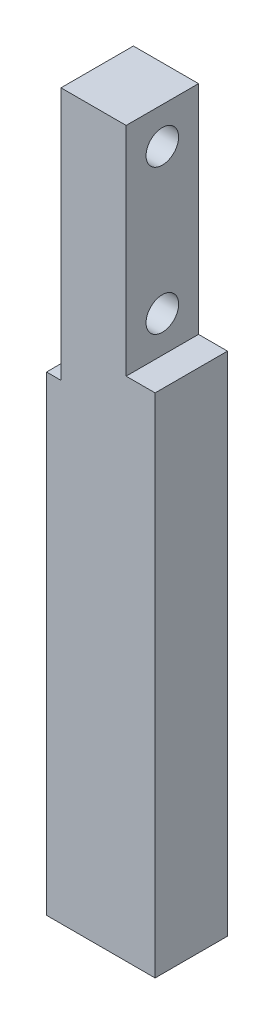
ISO-10303-21;
HEADER;
FILE_DESCRIPTION(('STEP AP214'),'2;1');
FILE_NAME('part.step','',(''),(''),'','','');
FILE_SCHEMA(('AUTOMOTIVE_DESIGN { 1 0 10303 214 1 1 1 1 }'));
ENDSEC;
DATA;
#1=APPLICATION_CONTEXT('core data for automotive mechanical design processes');
#2=APPLICATION_PROTOCOL_DEFINITION('international standard','automotive_design',2000,#1);
#3=PRODUCT_CONTEXT('',#1,'mechanical');
#4=PRODUCT('Part','Part','',(#3));
#5=PRODUCT_RELATED_PRODUCT_CATEGORY('part','',(#4));
#6=PRODUCT_DEFINITION_FORMATION('','',#4);
#7=PRODUCT_DEFINITION_CONTEXT('part definition',#1,'design');
#8=PRODUCT_DEFINITION('design','',#6,#7);
#9=PRODUCT_DEFINITION_SHAPE('','',#8);
#10=(LENGTH_UNIT() NAMED_UNIT(*) SI_UNIT(.MILLI.,.METRE.));
#11=(NAMED_UNIT(*) PLANE_ANGLE_UNIT() SI_UNIT($,.RADIAN.));
#12=(NAMED_UNIT(*) SI_UNIT($,.STERADIAN.) SOLID_ANGLE_UNIT());
#13=UNCERTAINTY_MEASURE_WITH_UNIT(LENGTH_MEASURE(1.E-05),#10,'distance_accuracy_value','');
#14=(GEOMETRIC_REPRESENTATION_CONTEXT(3) GLOBAL_UNCERTAINTY_ASSIGNED_CONTEXT((#13)) GLOBAL_UNIT_ASSIGNED_CONTEXT((#10,
#11,#12)) REPRESENTATION_CONTEXT('',''));
#15=CARTESIAN_POINT('',(0.,0.,0.));
#16=DIRECTION('',(0.,0.,1.));
#17=DIRECTION('',(1.,0.,0.));
#18=AXIS2_PLACEMENT_3D('',#15,#16,#17);
#19=CARTESIAN_POINT('',(-7.61200000000001,27.794,10.));
#20=DIRECTION('',(1.,0.,0.));
#21=DIRECTION('',(0.,0.,-1.));
#22=AXIS2_PLACEMENT_3D('',#19,#20,#21);
#23=PLANE('',#22);
#24=CARTESIAN_POINT('',(-7.61200000000001,37.794,5.));
#25=DIRECTION('',(-1.,0.,0.));
#26=DIRECTION('',(0.,0.,1.));
#27=AXIS2_PLACEMENT_3D('',#24,#25,#26);
#28=CIRCLE('',#27,4.);
#29=CARTESIAN_POINT('',(-7.61200000000001,37.794,9.00000000000001));
#30=VERTEX_POINT('',#29);
#31=EDGE_CURVE('E188',#30,#30,#28,.T.);
#32=ORIENTED_EDGE('',*,*,#31,.F.);
#33=EDGE_LOOP('',(#32));
#34=FACE_BOUND('',#33,.T.);
#35=CARTESIAN_POINT('',(-7.61200000000001,57.794,5.));
#36=DIRECTION('',(-1.,0.,0.));
#37=DIRECTION('',(0.,0.,1.));
#38=AXIS2_PLACEMENT_3D('',#35,#36,#37);
#39=CIRCLE('',#38,4.);
#40=CARTESIAN_POINT('',(-7.61200000000001,57.794,9.00000000000001));
#41=VERTEX_POINT('',#40);
#42=EDGE_CURVE('E182',#41,#41,#39,.T.);
#43=ORIENTED_EDGE('',*,*,#42,.F.);
#44=EDGE_LOOP('',(#43));
#45=FACE_BOUND('',#44,.T.);
#46=DIRECTION('',(0.,-1.,0.));
#47=VECTOR('',#46,1.);
#48=CARTESIAN_POINT('',(-7.61200000000001,27.794,0.));
#49=LINE('',#48,#47);
#50=CARTESIAN_POINT('',(-7.61200000000001,62.794,0.));
#51=VERTEX_POINT('',#50);
#52=CARTESIAN_POINT('',(-7.61200000000001,27.794,0.));
#53=VERTEX_POINT('',#52);
#54=EDGE_CURVE('E134',#51,#53,#49,.T.);
#55=ORIENTED_EDGE('',*,*,#54,.T.);
#56=DIRECTION('',(0.,0.,-1.));
#57=VECTOR('',#56,1.);
#58=CARTESIAN_POINT('',(-7.61200000000001,27.794,10.));
#59=LINE('',#58,#57);
#60=CARTESIAN_POINT('',(-7.61200000000001,27.794,10.));
#61=VERTEX_POINT('',#60);
#62=EDGE_CURVE('E11',#61,#53,#59,.T.);
#63=ORIENTED_EDGE('',*,*,#62,.F.);
#64=DIRECTION('',(0.,-1.,0.));
#65=VECTOR('',#64,1.);
#66=CARTESIAN_POINT('',(-7.61200000000001,27.794,10.));
#67=LINE('',#66,#65);
#68=CARTESIAN_POINT('',(-7.61200000000001,62.794,10.));
#69=VERTEX_POINT('',#68);
#70=EDGE_CURVE('E149',#69,#61,#67,.T.);
#71=ORIENTED_EDGE('',*,*,#70,.F.);
#72=DIRECTION('',(0.,0.,-1.));
#73=VECTOR('',#72,1.);
#74=CARTESIAN_POINT('',(-7.61200000000001,62.794,10.));
#75=LINE('',#74,#73);
#76=EDGE_CURVE('E130',#69,#51,#75,.T.);
#77=ORIENTED_EDGE('',*,*,#76,.T.);
#78=EDGE_LOOP('',(#55,#63,#71,#77));
#79=FACE_BOUND('',#78,.T.);
#80=ADVANCED_FACE('F35',(#34,#45,#79),#23,.F.);
#81=CARTESIAN_POINT('',(-9.612,27.794,10.));
#82=DIRECTION('',(0.,-1.,0.));
#83=DIRECTION('',(0.,0.,-1.));
#84=AXIS2_PLACEMENT_3D('',#81,#82,#83);
#85=PLANE('',#84);
#86=DIRECTION('',(-1.,0.,0.));
#87=VECTOR('',#86,1.);
#88=CARTESIAN_POINT('',(-9.612,27.794,0.));
#89=LINE('',#88,#87);
#90=CARTESIAN_POINT('',(-9.612,27.794,0.));
#91=VERTEX_POINT('',#90);
#92=EDGE_CURVE('E137',#53,#91,#89,.T.);
#93=ORIENTED_EDGE('',*,*,#92,.T.);
#94=DIRECTION('',(0.,0.,-1.));
#95=VECTOR('',#94,1.);
#96=CARTESIAN_POINT('',(-9.612,27.794,10.));
#97=LINE('',#96,#95);
#98=CARTESIAN_POINT('',(-9.612,27.794,10.));
#99=VERTEX_POINT('',#98);
#100=EDGE_CURVE('E43',#99,#91,#97,.T.);
#101=ORIENTED_EDGE('',*,*,#100,.F.);
#102=DIRECTION('',(-1.,0.,0.));
#103=VECTOR('',#102,1.);
#104=CARTESIAN_POINT('',(-9.612,27.794,10.));
#105=LINE('',#104,#103);
#106=EDGE_CURVE('E95',#61,#99,#105,.T.);
#107=ORIENTED_EDGE('',*,*,#106,.F.);
#108=ORIENTED_EDGE('',*,*,#62,.T.);
#109=EDGE_LOOP('',(#93,#101,#107,#108));
#110=FACE_BOUND('',#109,.T.);
#111=ADVANCED_FACE('F222',(#110),#85,.F.);
#112=CARTESIAN_POINT('',(-9.612,-37.206,10.));
#113=DIRECTION('',(1.,0.,0.));
#114=DIRECTION('',(0.,0.,-1.));
#115=AXIS2_PLACEMENT_3D('',#112,#113,#114);
#116=PLANE('',#115);
#117=CARTESIAN_POINT('',(-9.61200000000001,2.794,5.00000000000001));
#118=DIRECTION('',(-1.,0.,0.));
#119=DIRECTION('',(0.,0.,1.));
#120=AXIS2_PLACEMENT_3D('',#117,#118,#119);
#121=CIRCLE('',#120,1.64999999999999);
#122=CARTESIAN_POINT('',(-9.61200000000001,2.794,6.65));
#123=VERTEX_POINT('',#122);
#124=EDGE_CURVE('E214',#123,#123,#121,.T.);
#125=ORIENTED_EDGE('',*,*,#124,.F.);
#126=EDGE_LOOP('',(#125));
#127=FACE_BOUND('',#126,.T.);
#128=CARTESIAN_POINT('',(-9.61200000000001,-27.206,5.));
#129=DIRECTION('',(-1.,0.,0.));
#130=DIRECTION('',(0.,0.,1.));
#131=AXIS2_PLACEMENT_3D('',#128,#129,#130);
#132=CIRCLE('',#131,1.64999999999999);
#133=CARTESIAN_POINT('',(-9.61200000000001,-27.206,6.64999999999999));
#134=VERTEX_POINT('',#133);
#135=EDGE_CURVE('E208',#134,#134,#132,.T.);
#136=ORIENTED_EDGE('',*,*,#135,.F.);
#137=EDGE_LOOP('',(#136));
#138=FACE_BOUND('',#137,.T.);
#139=DIRECTION('',(0.,-1.,0.));
#140=VECTOR('',#139,1.);
#141=CARTESIAN_POINT('',(-9.612,-37.206,0.));
#142=LINE('',#141,#140);
#143=CARTESIAN_POINT('',(-9.612,-37.206,0.));
#144=VERTEX_POINT('',#143);
#145=EDGE_CURVE('E140',#91,#144,#142,.T.);
#146=ORIENTED_EDGE('',*,*,#145,.T.);
#147=DIRECTION('',(0.,0.,-1.));
#148=VECTOR('',#147,1.);
#149=CARTESIAN_POINT('',(-9.612,-37.206,10.));
#150=LINE('',#149,#148);
#151=CARTESIAN_POINT('',(-9.612,-37.206,10.));
#152=VERTEX_POINT('',#151);
#153=EDGE_CURVE('E156',#152,#144,#150,.T.);
#154=ORIENTED_EDGE('',*,*,#153,.F.);
#155=DIRECTION('',(0.,-1.,0.));
#156=VECTOR('',#155,1.);
#157=CARTESIAN_POINT('',(-9.612,-37.206,10.));
#158=LINE('',#157,#156);
#159=EDGE_CURVE('E164',#99,#152,#158,.T.);
#160=ORIENTED_EDGE('',*,*,#159,.F.);
#161=ORIENTED_EDGE('',*,*,#100,.T.);
#162=EDGE_LOOP('',(#146,#154,#160,#161));
#163=FACE_BOUND('',#162,.T.);
#164=ADVANCED_FACE('F162',(#127,#138,#163),#116,.F.);
#165=CARTESIAN_POINT('',(5.388,-37.206,10.));
#166=DIRECTION('',(0.,1.,0.));
#167=DIRECTION('',(0.,0.,1.));
#168=AXIS2_PLACEMENT_3D('',#165,#166,#167);
#169=PLANE('',#168);
#170=DIRECTION('',(1.,0.,0.));
#171=VECTOR('',#170,1.);
#172=CARTESIAN_POINT('',(5.388,-37.206,0.));
#173=LINE('',#172,#171);
#174=CARTESIAN_POINT('',(5.388,-37.206,0.));
#175=VERTEX_POINT('',#174);
#176=EDGE_CURVE('E142',#144,#175,#173,.T.);
#177=ORIENTED_EDGE('',*,*,#176,.T.);
#178=DIRECTION('',(0.,0.,-1.));
#179=VECTOR('',#178,1.);
#180=CARTESIAN_POINT('',(5.388,-37.206,10.));
#181=LINE('',#180,#179);
#182=CARTESIAN_POINT('',(5.388,-37.206,10.));
#183=VERTEX_POINT('',#182);
#184=EDGE_CURVE('E153',#183,#175,#181,.T.);
#185=ORIENTED_EDGE('',*,*,#184,.F.);
#186=DIRECTION('',(1.,0.,0.));
#187=VECTOR('',#186,1.);
#188=CARTESIAN_POINT('',(5.388,-37.206,10.));
#189=LINE('',#188,#187);
#190=EDGE_CURVE('E176',#152,#183,#189,.T.);
#191=ORIENTED_EDGE('',*,*,#190,.F.);
#192=ORIENTED_EDGE('',*,*,#153,.T.);
#193=EDGE_LOOP('',(#177,#185,#191,#192));
#194=FACE_BOUND('',#193,.T.);
#195=ADVANCED_FACE('F172',(#194),#169,.F.);
#196=CARTESIAN_POINT('',(5.38799999999999,32.794,10.));
#197=DIRECTION('',(-1.,0.,0.));
#198=DIRECTION('',(0.,-1.,0.));
#199=AXIS2_PLACEMENT_3D('',#196,#197,#198);
#200=PLANE('',#199);
#201=DIRECTION('',(0.,1.,0.));
#202=VECTOR('',#201,1.);
#203=CARTESIAN_POINT('',(5.38799999999999,32.794,0.));
#204=LINE('',#203,#202);
#205=CARTESIAN_POINT('',(5.38799999999999,32.794,0.));
#206=VERTEX_POINT('',#205);
#207=EDGE_CURVE('E144',#175,#206,#204,.T.);
#208=ORIENTED_EDGE('',*,*,#207,.T.);
#209=DIRECTION('',(0.,0.,-1.));
#210=VECTOR('',#209,1.);
#211=CARTESIAN_POINT('',(5.38799999999999,32.794,10.));
#212=LINE('',#211,#210);
#213=CARTESIAN_POINT('',(5.38799999999999,32.794,10.));
#214=VERTEX_POINT('',#213);
#215=EDGE_CURVE('E125',#214,#206,#212,.T.);
#216=ORIENTED_EDGE('',*,*,#215,.F.);
#217=DIRECTION('',(0.,1.,0.));
#218=VECTOR('',#217,1.);
#219=CARTESIAN_POINT('',(5.38799999999999,32.794,10.));
#220=LINE('',#219,#218);
#221=EDGE_CURVE('E116',#183,#214,#220,.T.);
#222=ORIENTED_EDGE('',*,*,#221,.F.);
#223=ORIENTED_EDGE('',*,*,#184,.T.);
#224=EDGE_LOOP('',(#208,#216,#222,#223));
#225=FACE_BOUND('',#224,.T.);
#226=ADVANCED_FACE('F175',(#225),#200,.F.);
#227=CARTESIAN_POINT('',(1.38799999999999,32.794,10.));
#228=DIRECTION('',(0.,-1.,0.));
#229=DIRECTION('',(0.,0.,-1.));
#230=AXIS2_PLACEMENT_3D('',#227,#228,#229);
#231=PLANE('',#230);
#232=DIRECTION('',(-1.,0.,0.));
#233=VECTOR('',#232,1.);
#234=CARTESIAN_POINT('',(1.38799999999999,32.794,0.));
#235=LINE('',#234,#233);
#236=CARTESIAN_POINT('',(1.38799999999999,32.794,0.));
#237=VERTEX_POINT('',#236);
#238=EDGE_CURVE('E124',#206,#237,#235,.T.);
#239=ORIENTED_EDGE('',*,*,#238,.T.);
#240=DIRECTION('',(0.,0.,-1.));
#241=VECTOR('',#240,1.);
#242=CARTESIAN_POINT('',(1.38799999999999,32.794,10.));
#243=LINE('',#242,#241);
#244=CARTESIAN_POINT('',(1.38799999999999,32.794,10.));
#245=VERTEX_POINT('',#244);
#246=EDGE_CURVE('E121',#245,#237,#243,.T.);
#247=ORIENTED_EDGE('',*,*,#246,.F.);
#248=DIRECTION('',(-1.,0.,0.));
#249=VECTOR('',#248,1.);
#250=CARTESIAN_POINT('',(1.38799999999999,32.794,10.));
#251=LINE('',#250,#249);
#252=EDGE_CURVE('E110',#214,#245,#251,.T.);
#253=ORIENTED_EDGE('',*,*,#252,.F.);
#254=ORIENTED_EDGE('',*,*,#215,.T.);
#255=EDGE_LOOP('',(#239,#247,#253,#254));
#256=FACE_BOUND('',#255,.T.);
#257=ADVANCED_FACE('F122',(#256),#231,.F.);
#258=CARTESIAN_POINT('',(1.38799999999999,62.794,10.));
#259=DIRECTION('',(-1.,0.,0.));
#260=DIRECTION('',(0.,-1.,0.));
#261=AXIS2_PLACEMENT_3D('',#258,#259,#260);
#262=PLANE('',#261);
#263=CARTESIAN_POINT('',(1.38799999999999,57.794,5.));
#264=DIRECTION('',(-1.,0.,0.));
#265=DIRECTION('',(0.,-1.,0.));
#266=AXIS2_PLACEMENT_3D('',#263,#264,#265);
#267=CIRCLE('',#266,2.25);
#268=CARTESIAN_POINT('',(1.38799999999999,55.544,5.));
#269=VERTEX_POINT('',#268);
#270=EDGE_CURVE('E199',#269,#269,#267,.T.);
#271=ORIENTED_EDGE('',*,*,#270,.T.);
#272=EDGE_LOOP('',(#271));
#273=FACE_BOUND('',#272,.T.);
#274=CARTESIAN_POINT('',(1.38799999999999,37.794,5.));
#275=DIRECTION('',(-1.,0.,0.));
#276=DIRECTION('',(0.,-1.,0.));
#277=AXIS2_PLACEMENT_3D('',#274,#275,#276);
#278=CIRCLE('',#277,2.25);
#279=CARTESIAN_POINT('',(1.38799999999999,35.544,5.));
#280=VERTEX_POINT('',#279);
#281=EDGE_CURVE('E191',#280,#280,#278,.T.);
#282=ORIENTED_EDGE('',*,*,#281,.T.);
#283=EDGE_LOOP('',(#282));
#284=FACE_BOUND('',#283,.T.);
#285=DIRECTION('',(0.,1.,0.));
#286=VECTOR('',#285,1.);
#287=CARTESIAN_POINT('',(1.38799999999999,62.794,0.));
#288=LINE('',#287,#286);
#289=CARTESIAN_POINT('',(1.38799999999999,62.794,0.));
#290=VERTEX_POINT('',#289);
#291=EDGE_CURVE('E81',#237,#290,#288,.T.);
#292=ORIENTED_EDGE('',*,*,#291,.T.);
#293=DIRECTION('',(0.,0.,-1.));
#294=VECTOR('',#293,1.);
#295=CARTESIAN_POINT('',(1.38799999999999,62.794,10.));
#296=LINE('',#295,#294);
#297=CARTESIAN_POINT('',(1.38799999999999,62.794,10.));
#298=VERTEX_POINT('',#297);
#299=EDGE_CURVE('E126',#298,#290,#296,.T.);
#300=ORIENTED_EDGE('',*,*,#299,.F.);
#301=DIRECTION('',(0.,1.,0.));
#302=VECTOR('',#301,1.);
#303=CARTESIAN_POINT('',(1.38799999999999,62.794,10.));
#304=LINE('',#303,#302);
#305=EDGE_CURVE('E114',#245,#298,#304,.T.);
#306=ORIENTED_EDGE('',*,*,#305,.F.);
#307=ORIENTED_EDGE('',*,*,#246,.T.);
#308=EDGE_LOOP('',(#292,#300,#306,#307));
#309=FACE_BOUND('',#308,.T.);
#310=ADVANCED_FACE('F128',(#273,#284,#309),#262,.F.);
#311=CARTESIAN_POINT('',(-7.61200000000001,62.794,10.));
#312=DIRECTION('',(0.,-1.,0.));
#313=DIRECTION('',(0.,0.,-1.));
#314=AXIS2_PLACEMENT_3D('',#311,#312,#313);
#315=PLANE('',#314);
#316=DIRECTION('',(-1.,0.,0.));
#317=VECTOR('',#316,1.);
#318=CARTESIAN_POINT('',(-7.61200000000001,62.794,0.));
#319=LINE('',#318,#317);
#320=EDGE_CURVE('E87',#290,#51,#319,.T.);
#321=ORIENTED_EDGE('',*,*,#320,.T.);
#322=ORIENTED_EDGE('',*,*,#76,.F.);
#323=DIRECTION('',(-1.,0.,0.));
#324=VECTOR('',#323,1.);
#325=CARTESIAN_POINT('',(-7.61200000000001,62.794,10.));
#326=LINE('',#325,#324);
#327=EDGE_CURVE('E51',#298,#69,#326,.T.);
#328=ORIENTED_EDGE('',*,*,#327,.F.);
#329=ORIENTED_EDGE('',*,*,#299,.T.);
#330=EDGE_LOOP('',(#321,#322,#328,#329));
#331=FACE_BOUND('',#330,.T.);
#332=ADVANCED_FACE('F253',(#331),#315,.F.);
#333=CARTESIAN_POINT('',(0.,0.,10.));
#334=DIRECTION('',(0.,0.,-1.));
#335=DIRECTION('',(-1.,0.,0.));
#336=AXIS2_PLACEMENT_3D('',#333,#334,#335);
#337=PLANE('',#336);
#338=ORIENTED_EDGE('',*,*,#70,.T.);
#339=ORIENTED_EDGE('',*,*,#106,.T.);
#340=ORIENTED_EDGE('',*,*,#159,.T.);
#341=ORIENTED_EDGE('',*,*,#190,.T.);
#342=ORIENTED_EDGE('',*,*,#221,.T.);
#343=ORIENTED_EDGE('',*,*,#252,.T.);
#344=ORIENTED_EDGE('',*,*,#305,.T.);
#345=ORIENTED_EDGE('',*,*,#327,.T.);
#346=EDGE_LOOP('',(#338,#339,#340,#341,#342,#343,#344,#345));
#347=FACE_BOUND('',#346,.T.);
#348=ADVANCED_FACE('F112',(#347),#337,.F.);
#349=CARTESIAN_POINT('',(0.,0.,0.));
#350=DIRECTION('',(0.,0.,-1.));
#351=DIRECTION('',(-1.,0.,0.));
#352=AXIS2_PLACEMENT_3D('',#349,#350,#351);
#353=PLANE('',#352);
#354=ORIENTED_EDGE('',*,*,#54,.F.);
#355=ORIENTED_EDGE('',*,*,#320,.F.);
#356=ORIENTED_EDGE('',*,*,#291,.F.);
#357=ORIENTED_EDGE('',*,*,#238,.F.);
#358=ORIENTED_EDGE('',*,*,#207,.F.);
#359=ORIENTED_EDGE('',*,*,#176,.F.);
#360=ORIENTED_EDGE('',*,*,#145,.F.);
#361=ORIENTED_EDGE('',*,*,#92,.F.);
#362=EDGE_LOOP('',(#354,#355,#356,#357,#358,#359,#360,#361));
#363=FACE_BOUND('',#362,.T.);
#364=ADVANCED_FACE('F168',(#363),#353,.T.);
#365=CARTESIAN_POINT('',(-3.11200000000001,57.794,5.));
#366=DIRECTION('',(-1.,0.,0.));
#367=DIRECTION('',(0.,0.,1.));
#368=AXIS2_PLACEMENT_3D('',#365,#366,#367);
#369=CYLINDRICAL_SURFACE('',#368,4.);
#370=CARTESIAN_POINT('',(-3.11200000000001,57.794,5.));
#371=DIRECTION('',(-1.,0.,0.));
#372=DIRECTION('',(0.,0.,1.));
#373=AXIS2_PLACEMENT_3D('',#370,#371,#372);
#374=CIRCLE('',#373,4.);
#375=CARTESIAN_POINT('',(-3.11200000000001,57.794,9.00000000000001));
#376=VERTEX_POINT('',#375);
#377=EDGE_CURVE('E138',#376,#376,#374,.T.);
#378=ORIENTED_EDGE('',*,*,#377,.F.);
#379=EDGE_LOOP('',(#378));
#380=FACE_BOUND('',#379,.T.);
#381=ORIENTED_EDGE('',*,*,#42,.T.);
#382=EDGE_LOOP('',(#381));
#383=FACE_BOUND('',#382,.T.);
#384=ADVANCED_FACE('F304',(#380,#383),#369,.F.);
#385=CARTESIAN_POINT('',(-3.11200000000001,57.794,5.));
#386=DIRECTION('',(-1.,0.,0.));
#387=DIRECTION('',(0.,0.,1.));
#388=AXIS2_PLACEMENT_3D('',#385,#386,#387);
#389=PLANE('',#388);
#390=CARTESIAN_POINT('',(-3.11200000000001,57.794,5.));
#391=DIRECTION('',(-1.,0.,0.));
#392=DIRECTION('',(0.,0.,1.));
#393=AXIS2_PLACEMENT_3D('',#390,#391,#392);
#394=CIRCLE('',#393,2.25);
#395=CARTESIAN_POINT('',(-3.11200000000001,57.794,7.25));
#396=VERTEX_POINT('',#395);
#397=EDGE_CURVE('E202',#396,#396,#394,.T.);
#398=ORIENTED_EDGE('',*,*,#397,.F.);
#399=EDGE_LOOP('',(#398));
#400=FACE_BOUND('',#399,.T.);
#401=ORIENTED_EDGE('',*,*,#377,.T.);
#402=EDGE_LOOP('',(#401));
#403=FACE_BOUND('',#402,.T.);
#404=ADVANCED_FACE('F299',(#400,#403),#389,.T.);
#405=CARTESIAN_POINT('',(-3.11200000000001,37.794,5.));
#406=DIRECTION('',(-1.,0.,0.));
#407=DIRECTION('',(0.,0.,1.));
#408=AXIS2_PLACEMENT_3D('',#405,#406,#407);
#409=CYLINDRICAL_SURFACE('',#408,4.);
#410=CARTESIAN_POINT('',(-3.11200000000001,37.794,5.));
#411=DIRECTION('',(-1.,0.,0.));
#412=DIRECTION('',(0.,0.,1.));
#413=AXIS2_PLACEMENT_3D('',#410,#411,#412);
#414=CIRCLE('',#413,4.);
#415=CARTESIAN_POINT('',(-3.11200000000001,37.794,9.00000000000001));
#416=VERTEX_POINT('',#415);
#417=EDGE_CURVE('E185',#416,#416,#414,.T.);
#418=ORIENTED_EDGE('',*,*,#417,.F.);
#419=EDGE_LOOP('',(#418));
#420=FACE_BOUND('',#419,.T.);
#421=ORIENTED_EDGE('',*,*,#31,.T.);
#422=EDGE_LOOP('',(#421));
#423=FACE_BOUND('',#422,.T.);
#424=ADVANCED_FACE('F294',(#420,#423),#409,.F.);
#425=CARTESIAN_POINT('',(-3.11200000000001,37.794,5.));
#426=DIRECTION('',(-1.,0.,0.));
#427=DIRECTION('',(0.,0.,1.));
#428=AXIS2_PLACEMENT_3D('',#425,#426,#427);
#429=PLANE('',#428);
#430=CARTESIAN_POINT('',(-3.11200000000001,37.794,5.));
#431=DIRECTION('',(-1.,0.,0.));
#432=DIRECTION('',(0.,0.,1.));
#433=AXIS2_PLACEMENT_3D('',#430,#431,#432);
#434=CIRCLE('',#433,2.25);
#435=CARTESIAN_POINT('',(-3.11200000000001,37.794,7.25));
#436=VERTEX_POINT('',#435);
#437=EDGE_CURVE('E196',#436,#436,#434,.T.);
#438=ORIENTED_EDGE('',*,*,#437,.F.);
#439=EDGE_LOOP('',(#438));
#440=FACE_BOUND('',#439,.T.);
#441=ORIENTED_EDGE('',*,*,#417,.T.);
#442=EDGE_LOOP('',(#441));
#443=FACE_BOUND('',#442,.T.);
#444=ADVANCED_FACE('F312',(#440,#443),#429,.T.);
#445=CARTESIAN_POINT('',(5.38799999999999,37.794,5.));
#446=DIRECTION('',(-1.,0.,0.));
#447=DIRECTION('',(0.,0.,1.));
#448=AXIS2_PLACEMENT_3D('',#445,#446,#447);
#449=CYLINDRICAL_SURFACE('',#448,2.25);
#450=ORIENTED_EDGE('',*,*,#437,.T.);
#451=EDGE_LOOP('',(#450));
#452=FACE_BOUND('',#451,.T.);
#453=ORIENTED_EDGE('',*,*,#281,.F.);
#454=EDGE_LOOP('',(#453));
#455=FACE_BOUND('',#454,.T.);
#456=ADVANCED_FACE('F317',(#452,#455),#449,.F.);
#457=CARTESIAN_POINT('',(5.38799999999999,57.794,5.));
#458=DIRECTION('',(-1.,0.,0.));
#459=DIRECTION('',(0.,0.,1.));
#460=AXIS2_PLACEMENT_3D('',#457,#458,#459);
#461=CYLINDRICAL_SURFACE('',#460,2.25);
#462=ORIENTED_EDGE('',*,*,#397,.T.);
#463=EDGE_LOOP('',(#462));
#464=FACE_BOUND('',#463,.T.);
#465=ORIENTED_EDGE('',*,*,#270,.F.);
#466=EDGE_LOOP('',(#465));
#467=FACE_BOUND('',#466,.T.);
#468=ADVANCED_FACE('F238',(#464,#467),#461,.F.);
#469=CARTESIAN_POINT('',(-1.612,-27.206,5.));
#470=DIRECTION('',(-1.,0.,0.));
#471=DIRECTION('',(0.,0.,1.));
#472=AXIS2_PLACEMENT_3D('',#469,#470,#471);
#473=CONICAL_SURFACE('',#472,1.65,1.02974425867665);
#474=CARTESIAN_POINT('',(-0.62057997860453,-27.206,5.));
#475=VERTEX_POINT('',#474);
#476=VERTEX_LOOP('',#475);
#477=FACE_BOUND('',#476,.T.);
#478=CARTESIAN_POINT('',(-1.612,-27.206,5.));
#479=DIRECTION('',(-1.,0.,0.));
#480=DIRECTION('',(0.,0.,1.));
#481=AXIS2_PLACEMENT_3D('',#478,#479,#480);
#482=CIRCLE('',#481,1.65);
#483=CARTESIAN_POINT('',(-1.612,-27.206,6.65));
#484=VERTEX_POINT('',#483);
#485=EDGE_CURVE('E205',#484,#484,#482,.T.);
#486=ORIENTED_EDGE('',*,*,#485,.T.);
#487=EDGE_LOOP('',(#486));
#488=FACE_BOUND('',#487,.T.);
#489=ADVANCED_FACE('F229',(#477,#488),#473,.F.);
#490=CARTESIAN_POINT('',(-9.612,-27.206,5.));
#491=DIRECTION('',(-1.,0.,0.));
#492=DIRECTION('',(0.,0.,1.));
#493=AXIS2_PLACEMENT_3D('',#490,#491,#492);
#494=CYLINDRICAL_SURFACE('',#493,1.65);
#495=ORIENTED_EDGE('',*,*,#485,.F.);
#496=EDGE_LOOP('',(#495));
#497=FACE_BOUND('',#496,.T.);
#498=ORIENTED_EDGE('',*,*,#135,.T.);
#499=EDGE_LOOP('',(#498));
#500=FACE_BOUND('',#499,.T.);
#501=ADVANCED_FACE('F226',(#497,#500),#494,.F.);
#502=CARTESIAN_POINT('',(-1.612,2.794,5.00000000000001));
#503=DIRECTION('',(-1.,0.,0.));
#504=DIRECTION('',(0.,0.,1.));
#505=AXIS2_PLACEMENT_3D('',#502,#503,#504);
#506=CONICAL_SURFACE('',#505,1.65,1.02974425867665);
#507=CARTESIAN_POINT('',(-0.62057997860453,2.794,5.00000000000001));
#508=VERTEX_POINT('',#507);
#509=VERTEX_LOOP('',#508);
#510=FACE_BOUND('',#509,.T.);
#511=CARTESIAN_POINT('',(-1.612,2.794,5.00000000000001));
#512=DIRECTION('',(-1.,0.,0.));
#513=DIRECTION('',(0.,0.,1.));
#514=AXIS2_PLACEMENT_3D('',#511,#512,#513);
#515=CIRCLE('',#514,1.65);
#516=CARTESIAN_POINT('',(-1.612,2.794,6.65));
#517=VERTEX_POINT('',#516);
#518=EDGE_CURVE('E211',#517,#517,#515,.T.);
#519=ORIENTED_EDGE('',*,*,#518,.T.);
#520=EDGE_LOOP('',(#519));
#521=FACE_BOUND('',#520,.T.);
#522=ADVANCED_FACE('F228',(#510,#521),#506,.F.);
#523=CARTESIAN_POINT('',(-9.612,2.794,5.00000000000001));
#524=DIRECTION('',(-1.,0.,0.));
#525=DIRECTION('',(0.,0.,1.));
#526=AXIS2_PLACEMENT_3D('',#523,#524,#525);
#527=CYLINDRICAL_SURFACE('',#526,1.64999999999999);
#528=ORIENTED_EDGE('',*,*,#518,.F.);
#529=EDGE_LOOP('',(#528));
#530=FACE_BOUND('',#529,.T.);
#531=ORIENTED_EDGE('',*,*,#124,.T.);
#532=EDGE_LOOP('',(#531));
#533=FACE_BOUND('',#532,.T.);
#534=ADVANCED_FACE('F218',(#530,#533),#527,.F.);
#535=CLOSED_SHELL('',(#80,#111,#164,#195,#226,#257,#310,#332,#348,#364,#384,#404,#424,#444,#456,
#468,#489,#501,#522,#534));
#536=MANIFOLD_SOLID_BREP('B2',#535);
#537=ADVANCED_BREP_SHAPE_REPRESENTATION('',(#18,#536),#14);
#538=SHAPE_DEFINITION_REPRESENTATION(#9,#537);
ENDSEC;
END-ISO-10303-21;
